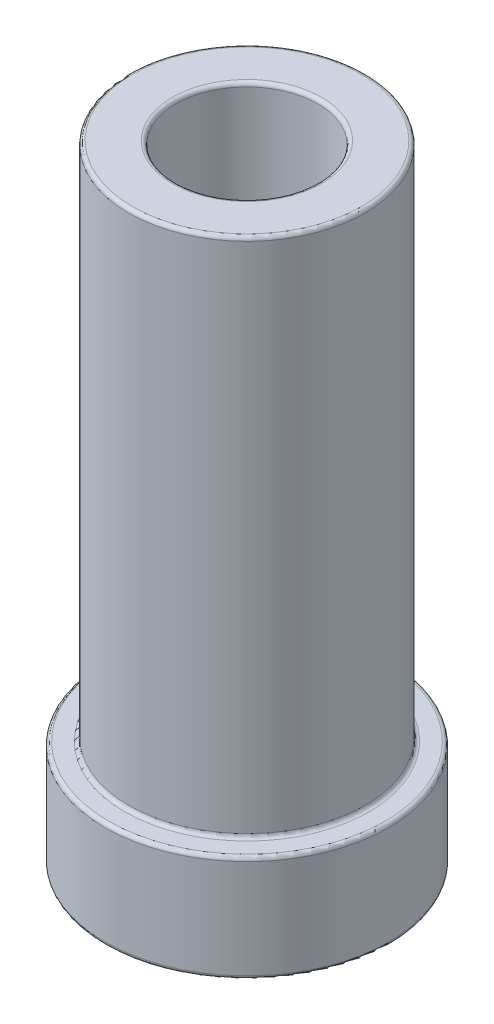
ISO-10303-21;
HEADER;
FILE_DESCRIPTION(('STEP AP214'),'2;1');
FILE_NAME('part.step','',(''),(''),'','','');
FILE_SCHEMA(('AUTOMOTIVE_DESIGN { 1 0 10303 214 1 1 1 1 }'));
ENDSEC;
DATA;
#1=APPLICATION_CONTEXT('core data for automotive mechanical design processes');
#2=APPLICATION_PROTOCOL_DEFINITION('international standard','automotive_design',2000,#1);
#3=PRODUCT_CONTEXT('',#1,'mechanical');
#4=PRODUCT('Part','Part','',(#3));
#5=PRODUCT_RELATED_PRODUCT_CATEGORY('part','',(#4));
#6=PRODUCT_DEFINITION_FORMATION('','',#4);
#7=PRODUCT_DEFINITION_CONTEXT('part definition',#1,'design');
#8=PRODUCT_DEFINITION('design','',#6,#7);
#9=PRODUCT_DEFINITION_SHAPE('','',#8);
#10=(LENGTH_UNIT() NAMED_UNIT(*) SI_UNIT(.MILLI.,.METRE.));
#11=(NAMED_UNIT(*) PLANE_ANGLE_UNIT() SI_UNIT($,.RADIAN.));
#12=(NAMED_UNIT(*) SI_UNIT($,.STERADIAN.) SOLID_ANGLE_UNIT());
#13=UNCERTAINTY_MEASURE_WITH_UNIT(LENGTH_MEASURE(1.E-05),#10,'distance_accuracy_value','');
#14=(GEOMETRIC_REPRESENTATION_CONTEXT(3) GLOBAL_UNCERTAINTY_ASSIGNED_CONTEXT((#13)) GLOBAL_UNIT_ASSIGNED_CONTEXT((#10,
#11,#12)) REPRESENTATION_CONTEXT('',''));
#15=CARTESIAN_POINT('',(0.,0.,0.));
#16=DIRECTION('',(0.,0.,1.));
#17=DIRECTION('',(1.,0.,0.));
#18=AXIS2_PLACEMENT_3D('',#15,#16,#17);
#19=CARTESIAN_POINT('',(0.,3.571875,0.));
#20=DIRECTION('',(0.,1.,0.));
#21=DIRECTION('',(0.,0.,1.));
#22=AXIS2_PLACEMENT_3D('',#19,#20,#21);
#23=PLANE('',#22);
#24=CARTESIAN_POINT('',(0.,3.571875,0.));
#25=DIRECTION('',(0.,1.,0.));
#26=DIRECTION('',(0.,0.,1.));
#27=AXIS2_PLACEMENT_3D('',#24,#25,#26);
#28=CIRCLE('',#27,4.6355);
#29=CARTESIAN_POINT('',(0.,3.571875,4.6355));
#30=VERTEX_POINT('',#29);
#31=EDGE_CURVE('E64',#30,#30,#28,.T.);
#32=ORIENTED_EDGE('',*,*,#31,.T.);
#33=EDGE_LOOP('',(#32));
#34=FACE_BOUND('',#33,.T.);
#35=CARTESIAN_POINT('',(0.,3.571875,0.));
#36=DIRECTION('',(0.,1.,0.));
#37=DIRECTION('',(0.,0.,1.));
#38=AXIS2_PLACEMENT_3D('',#35,#36,#37);
#39=CIRCLE('',#38,4.09575);
#40=CARTESIAN_POINT('',(0.,3.571875,4.09575));
#41=VERTEX_POINT('',#40);
#42=EDGE_CURVE('E68',#41,#41,#39,.F.);
#43=ORIENTED_EDGE('',*,*,#42,.T.);
#44=EDGE_LOOP('',(#43));
#45=FACE_BOUND('',#44,.T.);
#46=ADVANCED_FACE('F40',(#34,#45),#23,.T.);
#47=CARTESIAN_POINT('',(0.,0.,0.));
#48=DIRECTION('',(0.,1.,0.));
#49=DIRECTION('',(0.,0.,1.));
#50=AXIS2_PLACEMENT_3D('',#47,#48,#49);
#51=PLANE('',#50);
#52=CARTESIAN_POINT('',(0.,0.,0.));
#53=DIRECTION('',(0.,1.,0.));
#54=DIRECTION('',(0.,0.,1.));
#55=AXIS2_PLACEMENT_3D('',#52,#53,#54);
#56=CIRCLE('',#55,2.50825);
#57=CARTESIAN_POINT('',(0.,0.,2.50825));
#58=VERTEX_POINT('',#57);
#59=EDGE_CURVE('E10',#58,#58,#56,.T.);
#60=ORIENTED_EDGE('',*,*,#59,.T.);
#61=EDGE_LOOP('',(#60));
#62=FACE_BOUND('',#61,.T.);
#63=CARTESIAN_POINT('',(0.,0.,0.));
#64=DIRECTION('',(0.,1.,0.));
#65=DIRECTION('',(0.,0.,1.));
#66=AXIS2_PLACEMENT_3D('',#63,#64,#65);
#67=CIRCLE('',#66,4.6355);
#68=CARTESIAN_POINT('',(0.,0.,4.6355));
#69=VERTEX_POINT('',#68);
#70=EDGE_CURVE('E48',#69,#69,#67,.F.);
#71=ORIENTED_EDGE('',*,*,#70,.T.);
#72=EDGE_LOOP('',(#71));
#73=FACE_BOUND('',#72,.T.);
#74=ADVANCED_FACE('F112',(#62,#73),#51,.F.);
#75=CARTESIAN_POINT('',(0.,3.571875,0.));
#76=DIRECTION('',(0.,-1.,0.));
#77=DIRECTION('',(0.,0.,-1.));
#78=AXIS2_PLACEMENT_3D('',#75,#76,#77);
#79=CYLINDRICAL_SURFACE('',#78,4.7625);
#80=CARTESIAN_POINT('',(0.,3.444875,0.));
#81=DIRECTION('',(0.,1.,0.));
#82=DIRECTION('',(0.,0.,1.));
#83=AXIS2_PLACEMENT_3D('',#80,#81,#82);
#84=CIRCLE('',#83,4.7625);
#85=CARTESIAN_POINT('',(0.,3.444875,4.7625));
#86=VERTEX_POINT('',#85);
#87=EDGE_CURVE('E53',#86,#86,#84,.F.);
#88=ORIENTED_EDGE('',*,*,#87,.T.);
#89=EDGE_LOOP('',(#88));
#90=FACE_BOUND('',#89,.T.);
#91=CARTESIAN_POINT('',(0.,0.127,0.));
#92=DIRECTION('',(0.,1.,0.));
#93=DIRECTION('',(0.,0.,1.));
#94=AXIS2_PLACEMENT_3D('',#91,#92,#93);
#95=CIRCLE('',#94,4.7625);
#96=CARTESIAN_POINT('',(0.,0.127,4.7625));
#97=VERTEX_POINT('',#96);
#98=EDGE_CURVE('E58',#97,#97,#95,.T.);
#99=ORIENTED_EDGE('',*,*,#98,.T.);
#100=EDGE_LOOP('',(#99));
#101=FACE_BOUND('',#100,.T.);
#102=ADVANCED_FACE('F118',(#90,#101),#79,.T.);
#103=CARTESIAN_POINT('',(0.,3.571875,0.));
#104=DIRECTION('',(0.,-1.,0.));
#105=DIRECTION('',(0.,0.,-1.));
#106=AXIS2_PLACEMENT_3D('',#103,#104,#105);
#107=CYLINDRICAL_SURFACE('',#106,2.38125);
#108=CARTESIAN_POINT('',(0.,20.907375,0.));
#109=DIRECTION('',(0.,1.,0.));
#110=DIRECTION('',(0.,0.,1.));
#111=AXIS2_PLACEMENT_3D('',#108,#109,#110);
#112=CIRCLE('',#111,2.38125);
#113=CARTESIAN_POINT('',(0.,20.907375,2.38125));
#114=VERTEX_POINT('',#113);
#115=EDGE_CURVE('E88',#114,#114,#112,.T.);
#116=ORIENTED_EDGE('',*,*,#115,.T.);
#117=EDGE_LOOP('',(#116));
#118=FACE_BOUND('',#117,.T.);
#119=CARTESIAN_POINT('',(0.,0.127,0.));
#120=DIRECTION('',(0.,1.,0.));
#121=DIRECTION('',(0.,0.,1.));
#122=AXIS2_PLACEMENT_3D('',#119,#120,#121);
#123=CIRCLE('',#122,2.38125);
#124=CARTESIAN_POINT('',(0.,0.127,2.38125));
#125=VERTEX_POINT('',#124);
#126=EDGE_CURVE('E92',#125,#125,#123,.F.);
#127=ORIENTED_EDGE('',*,*,#126,.T.);
#128=EDGE_LOOP('',(#127));
#129=FACE_BOUND('',#128,.T.);
#130=ADVANCED_FACE('F97',(#118,#129),#107,.F.);
#131=CARTESIAN_POINT('',(0.,21.034375,0.));
#132=DIRECTION('',(0.,1.,0.));
#133=DIRECTION('',(0.,0.,1.));
#134=AXIS2_PLACEMENT_3D('',#131,#132,#133);
#135=PLANE('',#134);
#136=CARTESIAN_POINT('',(0.,21.034375,0.));
#137=DIRECTION('',(0.,1.,0.));
#138=DIRECTION('',(0.,0.,1.));
#139=AXIS2_PLACEMENT_3D('',#136,#137,#138);
#140=CIRCLE('',#139,2.50825);
#141=CARTESIAN_POINT('',(0.,21.034375,2.50825));
#142=VERTEX_POINT('',#141);
#143=EDGE_CURVE('E80',#142,#142,#140,.F.);
#144=ORIENTED_EDGE('',*,*,#143,.T.);
#145=EDGE_LOOP('',(#144));
#146=FACE_BOUND('',#145,.T.);
#147=CARTESIAN_POINT('',(0.,21.034375,0.));
#148=DIRECTION('',(0.,1.,0.));
#149=DIRECTION('',(0.,0.,1.));
#150=AXIS2_PLACEMENT_3D('',#147,#148,#149);
#151=CIRCLE('',#150,3.84175);
#152=CARTESIAN_POINT('',(0.,21.034375,3.84175));
#153=VERTEX_POINT('',#152);
#154=EDGE_CURVE('E84',#153,#153,#151,.T.);
#155=ORIENTED_EDGE('',*,*,#154,.T.);
#156=EDGE_LOOP('',(#155));
#157=FACE_BOUND('',#156,.T.);
#158=ADVANCED_FACE('F192',(#146,#157),#135,.T.);
#159=CARTESIAN_POINT('',(0.,21.034375,0.));
#160=DIRECTION('',(0.,-1.,0.));
#161=DIRECTION('',(0.,0.,-1.));
#162=AXIS2_PLACEMENT_3D('',#159,#160,#161);
#163=CYLINDRICAL_SURFACE('',#162,3.96875);
#164=CARTESIAN_POINT('',(0.,20.907375,0.));
#165=DIRECTION('',(0.,1.,0.));
#166=DIRECTION('',(0.,0.,1.));
#167=AXIS2_PLACEMENT_3D('',#164,#165,#166);
#168=CIRCLE('',#167,3.96875);
#169=CARTESIAN_POINT('',(0.,20.907375,3.96875));
#170=VERTEX_POINT('',#169);
#171=EDGE_CURVE('E72',#170,#170,#168,.F.);
#172=ORIENTED_EDGE('',*,*,#171,.T.);
#173=EDGE_LOOP('',(#172));
#174=FACE_BOUND('',#173,.T.);
#175=CARTESIAN_POINT('',(0.,3.698875,0.));
#176=DIRECTION('',(0.,1.,0.));
#177=DIRECTION('',(0.,0.,1.));
#178=AXIS2_PLACEMENT_3D('',#175,#176,#177);
#179=CIRCLE('',#178,3.96875);
#180=CARTESIAN_POINT('',(0.,3.698875,3.96875));
#181=VERTEX_POINT('',#180);
#182=EDGE_CURVE('E76',#181,#181,#179,.T.);
#183=ORIENTED_EDGE('',*,*,#182,.T.);
#184=EDGE_LOOP('',(#183));
#185=FACE_BOUND('',#184,.T.);
#186=ADVANCED_FACE('F131',(#174,#185),#163,.T.);
#187=CARTESIAN_POINT('',(0.,20.907375,0.));
#188=DIRECTION('',(0.,1.,0.));
#189=DIRECTION('',(0.,0.,1.));
#190=AXIS2_PLACEMENT_3D('',#187,#188,#189);
#191=TOROIDAL_SURFACE('',#190,2.50825,0.127);
#192=ORIENTED_EDGE('',*,*,#143,.F.);
#193=EDGE_LOOP('',(#192));
#194=FACE_BOUND('',#193,.T.);
#195=ORIENTED_EDGE('',*,*,#115,.F.);
#196=EDGE_LOOP('',(#195));
#197=FACE_BOUND('',#196,.T.);
#198=ADVANCED_FACE('F127',(#194,#197),#191,.T.);
#199=CARTESIAN_POINT('',(0.,20.907375,0.));
#200=DIRECTION('',(0.,1.,0.));
#201=DIRECTION('',(0.,0.,1.));
#202=AXIS2_PLACEMENT_3D('',#199,#200,#201);
#203=TOROIDAL_SURFACE('',#202,3.84175,0.127);
#204=ORIENTED_EDGE('',*,*,#171,.F.);
#205=EDGE_LOOP('',(#204));
#206=FACE_BOUND('',#205,.T.);
#207=ORIENTED_EDGE('',*,*,#154,.F.);
#208=EDGE_LOOP('',(#207));
#209=FACE_BOUND('',#208,.T.);
#210=ADVANCED_FACE('F130',(#206,#209),#203,.T.);
#211=CARTESIAN_POINT('',(0.,3.444875,0.));
#212=DIRECTION('',(0.,1.,0.));
#213=DIRECTION('',(0.,0.,1.));
#214=AXIS2_PLACEMENT_3D('',#211,#212,#213);
#215=TOROIDAL_SURFACE('',#214,4.6355,0.127);
#216=ORIENTED_EDGE('',*,*,#87,.F.);
#217=EDGE_LOOP('',(#216));
#218=FACE_BOUND('',#217,.T.);
#219=ORIENTED_EDGE('',*,*,#31,.F.);
#220=EDGE_LOOP('',(#219));
#221=FACE_BOUND('',#220,.T.);
#222=ADVANCED_FACE('F108',(#218,#221),#215,.T.);
#223=CARTESIAN_POINT('',(0.,3.698875,0.));
#224=DIRECTION('',(0.,1.,0.));
#225=DIRECTION('',(0.,0.,1.));
#226=AXIS2_PLACEMENT_3D('',#223,#224,#225);
#227=TOROIDAL_SURFACE('',#226,4.09575,0.127);
#228=ORIENTED_EDGE('',*,*,#42,.F.);
#229=EDGE_LOOP('',(#228));
#230=FACE_BOUND('',#229,.T.);
#231=ORIENTED_EDGE('',*,*,#182,.F.);
#232=EDGE_LOOP('',(#231));
#233=FACE_BOUND('',#232,.T.);
#234=ADVANCED_FACE('F102',(#230,#233),#227,.F.);
#235=CARTESIAN_POINT('',(0.,0.127,0.));
#236=DIRECTION('',(0.,1.,0.));
#237=DIRECTION('',(0.,0.,1.));
#238=AXIS2_PLACEMENT_3D('',#235,#236,#237);
#239=TOROIDAL_SURFACE('',#238,2.50825,0.127);
#240=ORIENTED_EDGE('',*,*,#126,.F.);
#241=EDGE_LOOP('',(#240));
#242=FACE_BOUND('',#241,.T.);
#243=ORIENTED_EDGE('',*,*,#59,.F.);
#244=EDGE_LOOP('',(#243));
#245=FACE_BOUND('',#244,.T.);
#246=ADVANCED_FACE('F99',(#242,#245),#239,.T.);
#247=CARTESIAN_POINT('',(0.,0.127,0.));
#248=DIRECTION('',(0.,1.,0.));
#249=DIRECTION('',(0.,0.,1.));
#250=AXIS2_PLACEMENT_3D('',#247,#248,#249);
#251=TOROIDAL_SURFACE('',#250,4.6355,0.127);
#252=ORIENTED_EDGE('',*,*,#70,.F.);
#253=EDGE_LOOP('',(#252));
#254=FACE_BOUND('',#253,.T.);
#255=ORIENTED_EDGE('',*,*,#98,.F.);
#256=EDGE_LOOP('',(#255));
#257=FACE_BOUND('',#256,.T.);
#258=ADVANCED_FACE('F42',(#254,#257),#251,.T.);
#259=CLOSED_SHELL('',(#46,#74,#102,#130,#158,#186,#198,#210,#222,#234,#246,#258));
#260=MANIFOLD_SOLID_BREP('B2',#259);
#261=ADVANCED_BREP_SHAPE_REPRESENTATION('',(#18,#260),#14);
#262=SHAPE_DEFINITION_REPRESENTATION(#9,#261);
ENDSEC;
END-ISO-10303-21;
